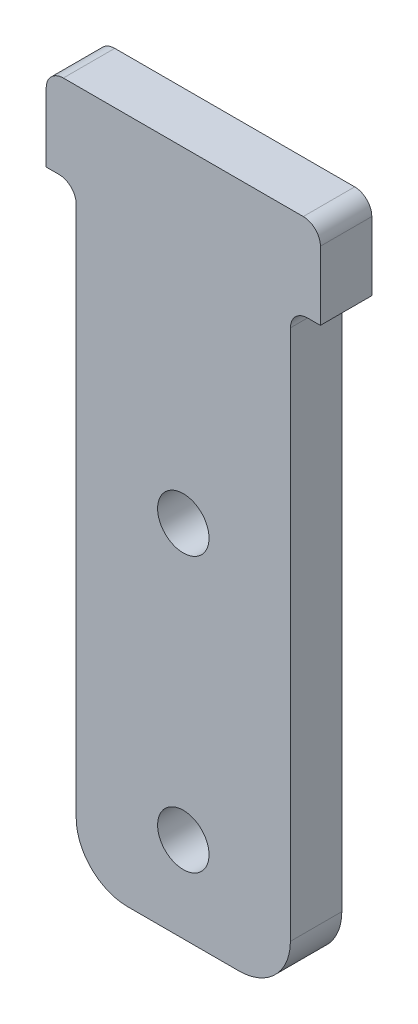
ISO-10303-21;
HEADER;
FILE_DESCRIPTION(('STEP AP214'),'2;1');
FILE_NAME('part.step','',(''),(''),'','','');
FILE_SCHEMA(('AUTOMOTIVE_DESIGN { 1 0 10303 214 1 1 1 1 }'));
ENDSEC;
DATA;
#1=APPLICATION_CONTEXT('core data for automotive mechanical design processes');
#2=APPLICATION_PROTOCOL_DEFINITION('international standard','automotive_design',2000,#1);
#3=PRODUCT_CONTEXT('',#1,'mechanical');
#4=PRODUCT('Part','Part','',(#3));
#5=PRODUCT_RELATED_PRODUCT_CATEGORY('part','',(#4));
#6=PRODUCT_DEFINITION_FORMATION('','',#4);
#7=PRODUCT_DEFINITION_CONTEXT('part definition',#1,'design');
#8=PRODUCT_DEFINITION('design','',#6,#7);
#9=PRODUCT_DEFINITION_SHAPE('','',#8);
#10=(LENGTH_UNIT() NAMED_UNIT(*) SI_UNIT(.MILLI.,.METRE.));
#11=(NAMED_UNIT(*) PLANE_ANGLE_UNIT() SI_UNIT($,.RADIAN.));
#12=(NAMED_UNIT(*) SI_UNIT($,.STERADIAN.) SOLID_ANGLE_UNIT());
#13=UNCERTAINTY_MEASURE_WITH_UNIT(LENGTH_MEASURE(1.E-05),#10,'distance_accuracy_value','');
#14=(GEOMETRIC_REPRESENTATION_CONTEXT(3) GLOBAL_UNCERTAINTY_ASSIGNED_CONTEXT((#13)) GLOBAL_UNIT_ASSIGNED_CONTEXT((#10,
#11,#12)) REPRESENTATION_CONTEXT('',''));
#15=CARTESIAN_POINT('',(0.,0.,0.));
#16=DIRECTION('',(0.,0.,1.));
#17=DIRECTION('',(1.,0.,0.));
#18=AXIS2_PLACEMENT_3D('',#15,#16,#17);
#19=CARTESIAN_POINT('',(0.,0.,3.));
#20=DIRECTION('',(0.,0.,1.));
#21=DIRECTION('',(1.,0.,0.));
#22=AXIS2_PLACEMENT_3D('',#19,#20,#21);
#23=PLANE('',#22);
#24=CARTESIAN_POINT('',(0.,3.5,3.));
#25=DIRECTION('',(0.,0.,1.));
#26=DIRECTION('',(1.,0.,0.));
#27=AXIS2_PLACEMENT_3D('',#24,#25,#26);
#28=CIRCLE('',#27,1.5);
#29=CARTESIAN_POINT('',(1.50000000000001,3.5,3.));
#30=VERTEX_POINT('',#29);
#31=EDGE_CURVE('E179',#30,#30,#28,.T.);
#32=ORIENTED_EDGE('',*,*,#31,.F.);
#33=EDGE_LOOP('',(#32));
#34=FACE_BOUND('',#33,.T.);
#35=DIRECTION('',(1.,0.,0.));
#36=VECTOR('',#35,1.);
#37=CARTESIAN_POINT('',(-6.25,-17.5,3.));
#38=LINE('',#37,#36);
#39=CARTESIAN_POINT('',(-3.24999999999999,-17.5,3.));
#40=VERTEX_POINT('',#39);
#41=CARTESIAN_POINT('',(3.25000000000001,-17.5,3.));
#42=VERTEX_POINT('',#41);
#43=EDGE_CURVE('E166',#40,#42,#38,.T.);
#44=ORIENTED_EDGE('',*,*,#43,.T.);
#45=CARTESIAN_POINT('',(3.25000000000001,-14.5,3.));
#46=DIRECTION('',(0.,0.,1.));
#47=DIRECTION('',(1.,0.,0.));
#48=AXIS2_PLACEMENT_3D('',#45,#46,#47);
#49=CIRCLE('',#48,3.);
#50=CARTESIAN_POINT('',(6.25000000000001,-14.5,3.));
#51=VERTEX_POINT('',#50);
#52=EDGE_CURVE('E41',#42,#51,#49,.T.);
#53=ORIENTED_EDGE('',*,*,#52,.T.);
#54=DIRECTION('',(0.,1.,0.));
#55=VECTOR('',#54,1.);
#56=CARTESIAN_POINT('',(6.25000000000001,17.5,3.));
#57=LINE('',#56,#55);
#58=CARTESIAN_POINT('',(6.25000000000001,16.5,3.));
#59=VERTEX_POINT('',#58);
#60=EDGE_CURVE('E171',#51,#59,#57,.T.);
#61=ORIENTED_EDGE('',*,*,#60,.T.);
#62=CARTESIAN_POINT('',(7.25000000000001,16.5,3.));
#63=DIRECTION('',(0.,0.,1.));
#64=DIRECTION('',(1.,0.,0.));
#65=AXIS2_PLACEMENT_3D('',#62,#63,#64);
#66=CIRCLE('',#65,1.);
#67=CARTESIAN_POINT('',(7.25,17.5,3.));
#68=VERTEX_POINT('',#67);
#69=EDGE_CURVE('E224',#59,#68,#66,.F.);
#70=ORIENTED_EDGE('',*,*,#69,.T.);
#71=DIRECTION('',(1.,0.,0.));
#72=VECTOR('',#71,1.);
#73=CARTESIAN_POINT('',(6.25000000000001,17.5,3.));
#74=LINE('',#73,#72);
#75=CARTESIAN_POINT('',(8.,17.5,3.));
#76=VERTEX_POINT('',#75);
#77=EDGE_CURVE('E173',#68,#76,#74,.T.);
#78=ORIENTED_EDGE('',*,*,#77,.T.);
#79=DIRECTION('',(0.,1.,0.));
#80=VECTOR('',#79,1.);
#81=CARTESIAN_POINT('',(8.,22.5,3.));
#82=LINE('',#81,#80);
#83=CARTESIAN_POINT('',(8.,21.5,3.));
#84=VERTEX_POINT('',#83);
#85=EDGE_CURVE('E193',#76,#84,#82,.T.);
#86=ORIENTED_EDGE('',*,*,#85,.T.);
#87=CARTESIAN_POINT('',(7.,21.5,3.));
#88=DIRECTION('',(0.,0.,1.));
#89=DIRECTION('',(1.,0.,0.));
#90=AXIS2_PLACEMENT_3D('',#87,#88,#89);
#91=CIRCLE('',#90,1.);
#92=CARTESIAN_POINT('',(7.,22.5,3.));
#93=VERTEX_POINT('',#92);
#94=EDGE_CURVE('E206',#84,#93,#91,.T.);
#95=ORIENTED_EDGE('',*,*,#94,.T.);
#96=DIRECTION('',(-1.,0.,0.));
#97=VECTOR('',#96,1.);
#98=CARTESIAN_POINT('',(-8.,22.5,3.));
#99=LINE('',#98,#97);
#100=CARTESIAN_POINT('',(-7.,22.5,3.));
#101=VERTEX_POINT('',#100);
#102=EDGE_CURVE('E148',#93,#101,#99,.T.);
#103=ORIENTED_EDGE('',*,*,#102,.T.);
#104=CARTESIAN_POINT('',(-7.,21.5,3.));
#105=DIRECTION('',(0.,0.,1.));
#106=DIRECTION('',(1.,0.,0.));
#107=AXIS2_PLACEMENT_3D('',#104,#105,#106);
#108=CIRCLE('',#107,1.);
#109=CARTESIAN_POINT('',(-8.,21.5,3.));
#110=VERTEX_POINT('',#109);
#111=EDGE_CURVE('E144',#101,#110,#108,.T.);
#112=ORIENTED_EDGE('',*,*,#111,.T.);
#113=DIRECTION('',(0.,-1.,0.));
#114=VECTOR('',#113,1.);
#115=CARTESIAN_POINT('',(-8.,22.5,3.));
#116=LINE('',#115,#114);
#117=CARTESIAN_POINT('',(-8.,17.5,3.));
#118=VERTEX_POINT('',#117);
#119=EDGE_CURVE('E136',#110,#118,#116,.T.);
#120=ORIENTED_EDGE('',*,*,#119,.T.);
#121=DIRECTION('',(1.,0.,0.));
#122=VECTOR('',#121,1.);
#123=CARTESIAN_POINT('',(-8.,17.5,3.));
#124=LINE('',#123,#122);
#125=CARTESIAN_POINT('',(-7.25,17.5,3.));
#126=VERTEX_POINT('',#125);
#127=EDGE_CURVE('E140',#118,#126,#124,.T.);
#128=ORIENTED_EDGE('',*,*,#127,.T.);
#129=CARTESIAN_POINT('',(-7.25,16.5,3.));
#130=DIRECTION('',(0.,0.,1.));
#131=DIRECTION('',(1.,0.,0.));
#132=AXIS2_PLACEMENT_3D('',#129,#130,#131);
#133=CIRCLE('',#132,1.);
#134=CARTESIAN_POINT('',(-6.25,16.5,3.));
#135=VERTEX_POINT('',#134);
#136=EDGE_CURVE('E228',#126,#135,#133,.F.);
#137=ORIENTED_EDGE('',*,*,#136,.T.);
#138=DIRECTION('',(0.,-1.,0.));
#139=VECTOR('',#138,1.);
#140=CARTESIAN_POINT('',(-6.25,17.5,3.));
#141=LINE('',#140,#139);
#142=CARTESIAN_POINT('',(-6.25,-14.5,3.));
#143=VERTEX_POINT('',#142);
#144=EDGE_CURVE('E164',#135,#143,#141,.T.);
#145=ORIENTED_EDGE('',*,*,#144,.T.);
#146=CARTESIAN_POINT('',(-3.25,-14.5,3.));
#147=DIRECTION('',(0.,0.,1.));
#148=DIRECTION('',(1.,0.,0.));
#149=AXIS2_PLACEMENT_3D('',#146,#147,#148);
#150=CIRCLE('',#149,3.);
#151=EDGE_CURVE('E241',#143,#40,#150,.T.);
#152=ORIENTED_EDGE('',*,*,#151,.T.);
#153=EDGE_LOOP('',(#44,#53,#61,#70,#78,#86,#95,#103,#112,#120,#128,#137,#145,#152));
#154=FACE_BOUND('',#153,.T.);
#155=CARTESIAN_POINT('',(0.,-12.5,3.));
#156=DIRECTION('',(0.,0.,1.));
#157=DIRECTION('',(1.,0.,0.));
#158=AXIS2_PLACEMENT_3D('',#155,#156,#157);
#159=CIRCLE('',#158,1.5);
#160=CARTESIAN_POINT('',(1.50000000000001,-12.5,3.));
#161=VERTEX_POINT('',#160);
#162=EDGE_CURVE('E330',#161,#161,#159,.T.);
#163=ORIENTED_EDGE('',*,*,#162,.F.);
#164=EDGE_LOOP('',(#163));
#165=FACE_BOUND('',#164,.T.);
#166=ADVANCED_FACE('F33',(#34,#154,#165),#23,.T.);
#167=CARTESIAN_POINT('',(0.,0.,0.));
#168=DIRECTION('',(0.,0.,1.));
#169=DIRECTION('',(1.,0.,0.));
#170=AXIS2_PLACEMENT_3D('',#167,#168,#169);
#171=PLANE('',#170);
#172=DIRECTION('',(0.,1.,0.));
#173=VECTOR('',#172,1.);
#174=CARTESIAN_POINT('',(6.25000000000001,17.5,0.));
#175=LINE('',#174,#173);
#176=CARTESIAN_POINT('',(6.25000000000001,-14.5,0.));
#177=VERTEX_POINT('',#176);
#178=CARTESIAN_POINT('',(6.25000000000001,16.5,0.));
#179=VERTEX_POINT('',#178);
#180=EDGE_CURVE('E189',#177,#179,#175,.T.);
#181=ORIENTED_EDGE('',*,*,#180,.F.);
#182=CARTESIAN_POINT('',(3.25000000000001,-14.5,0.));
#183=DIRECTION('',(0.,0.,1.));
#184=DIRECTION('',(1.,0.,0.));
#185=AXIS2_PLACEMENT_3D('',#182,#183,#184);
#186=CIRCLE('',#185,3.);
#187=CARTESIAN_POINT('',(3.25000000000001,-17.5,0.));
#188=VERTEX_POINT('',#187);
#189=EDGE_CURVE('E235',#177,#188,#186,.F.);
#190=ORIENTED_EDGE('',*,*,#189,.T.);
#191=DIRECTION('',(1.,0.,0.));
#192=VECTOR('',#191,1.);
#193=CARTESIAN_POINT('',(-6.25,-17.5,0.));
#194=LINE('',#193,#192);
#195=CARTESIAN_POINT('',(-3.24999999999999,-17.5,0.));
#196=VERTEX_POINT('',#195);
#197=EDGE_CURVE('E187',#196,#188,#194,.T.);
#198=ORIENTED_EDGE('',*,*,#197,.F.);
#199=CARTESIAN_POINT('',(-3.25,-14.5,0.));
#200=DIRECTION('',(0.,0.,1.));
#201=DIRECTION('',(1.,0.,0.));
#202=AXIS2_PLACEMENT_3D('',#199,#200,#201);
#203=CIRCLE('',#202,3.);
#204=CARTESIAN_POINT('',(-6.25,-14.5,0.));
#205=VERTEX_POINT('',#204);
#206=EDGE_CURVE('E233',#196,#205,#203,.F.);
#207=ORIENTED_EDGE('',*,*,#206,.T.);
#208=DIRECTION('',(0.,-1.,0.));
#209=VECTOR('',#208,1.);
#210=CARTESIAN_POINT('',(-6.25,17.5,0.));
#211=LINE('',#210,#209);
#212=CARTESIAN_POINT('',(-6.25,16.5,0.));
#213=VERTEX_POINT('',#212);
#214=EDGE_CURVE('E185',#213,#205,#211,.T.);
#215=ORIENTED_EDGE('',*,*,#214,.F.);
#216=CARTESIAN_POINT('',(-7.25,16.5,0.));
#217=DIRECTION('',(0.,0.,1.));
#218=DIRECTION('',(1.,0.,0.));
#219=AXIS2_PLACEMENT_3D('',#216,#217,#218);
#220=CIRCLE('',#219,1.);
#221=CARTESIAN_POINT('',(-7.25,17.5,0.));
#222=VERTEX_POINT('',#221);
#223=EDGE_CURVE('E226',#213,#222,#220,.T.);
#224=ORIENTED_EDGE('',*,*,#223,.T.);
#225=DIRECTION('',(1.,0.,0.));
#226=VECTOR('',#225,1.);
#227=CARTESIAN_POINT('',(-8.,17.5,0.));
#228=LINE('',#227,#226);
#229=CARTESIAN_POINT('',(-8.,17.5,0.));
#230=VERTEX_POINT('',#229);
#231=EDGE_CURVE('E183',#230,#222,#228,.T.);
#232=ORIENTED_EDGE('',*,*,#231,.F.);
#233=DIRECTION('',(0.,-1.,0.));
#234=VECTOR('',#233,1.);
#235=CARTESIAN_POINT('',(-8.,22.5,0.));
#236=LINE('',#235,#234);
#237=CARTESIAN_POINT('',(-8.,21.5,0.));
#238=VERTEX_POINT('',#237);
#239=EDGE_CURVE('E154',#238,#230,#236,.T.);
#240=ORIENTED_EDGE('',*,*,#239,.F.);
#241=CARTESIAN_POINT('',(-7.,21.5,0.));
#242=DIRECTION('',(0.,0.,1.));
#243=DIRECTION('',(1.,0.,0.));
#244=AXIS2_PLACEMENT_3D('',#241,#242,#243);
#245=CIRCLE('',#244,1.);
#246=CARTESIAN_POINT('',(-7.,22.5,0.));
#247=VERTEX_POINT('',#246);
#248=EDGE_CURVE('E199',#238,#247,#245,.F.);
#249=ORIENTED_EDGE('',*,*,#248,.T.);
#250=DIRECTION('',(-1.,0.,0.));
#251=VECTOR('',#250,1.);
#252=CARTESIAN_POINT('',(-8.,22.5,0.));
#253=LINE('',#252,#251);
#254=CARTESIAN_POINT('',(7.,22.5,0.));
#255=VERTEX_POINT('',#254);
#256=EDGE_CURVE('E178',#255,#247,#253,.T.);
#257=ORIENTED_EDGE('',*,*,#256,.F.);
#258=CARTESIAN_POINT('',(7.,21.5,0.));
#259=DIRECTION('',(0.,0.,1.));
#260=DIRECTION('',(1.,0.,0.));
#261=AXIS2_PLACEMENT_3D('',#258,#259,#260);
#262=CIRCLE('',#261,1.);
#263=CARTESIAN_POINT('',(8.,21.5,0.));
#264=VERTEX_POINT('',#263);
#265=EDGE_CURVE('E197',#255,#264,#262,.F.);
#266=ORIENTED_EDGE('',*,*,#265,.T.);
#267=DIRECTION('',(0.,1.,0.));
#268=VECTOR('',#267,1.);
#269=CARTESIAN_POINT('',(8.,22.5,0.));
#270=LINE('',#269,#268);
#271=CARTESIAN_POINT('',(8.,17.5,0.));
#272=VERTEX_POINT('',#271);
#273=EDGE_CURVE('E175',#272,#264,#270,.T.);
#274=ORIENTED_EDGE('',*,*,#273,.F.);
#275=DIRECTION('',(1.,0.,0.));
#276=VECTOR('',#275,1.);
#277=CARTESIAN_POINT('',(6.25000000000001,17.5,0.));
#278=LINE('',#277,#276);
#279=CARTESIAN_POINT('',(7.25,17.5,0.));
#280=VERTEX_POINT('',#279);
#281=EDGE_CURVE('E191',#280,#272,#278,.T.);
#282=ORIENTED_EDGE('',*,*,#281,.F.);
#283=CARTESIAN_POINT('',(7.25000000000001,16.5,0.));
#284=DIRECTION('',(0.,0.,1.));
#285=DIRECTION('',(1.,0.,0.));
#286=AXIS2_PLACEMENT_3D('',#283,#284,#285);
#287=CIRCLE('',#286,1.);
#288=EDGE_CURVE('E221',#280,#179,#287,.T.);
#289=ORIENTED_EDGE('',*,*,#288,.T.);
#290=EDGE_LOOP('',(#181,#190,#198,#207,#215,#224,#232,#240,#249,#257,#266,#274,#282,#289));
#291=FACE_BOUND('',#290,.T.);
#292=CARTESIAN_POINT('',(0.,3.5,0.));
#293=DIRECTION('',(0.,0.,1.));
#294=DIRECTION('',(1.,0.,0.));
#295=AXIS2_PLACEMENT_3D('',#292,#293,#294);
#296=CIRCLE('',#295,1.5);
#297=CARTESIAN_POINT('',(1.50000000000001,3.5,0.));
#298=VERTEX_POINT('',#297);
#299=EDGE_CURVE('E327',#298,#298,#296,.T.);
#300=ORIENTED_EDGE('',*,*,#299,.T.);
#301=EDGE_LOOP('',(#300));
#302=FACE_BOUND('',#301,.T.);
#303=CARTESIAN_POINT('',(0.,-12.5,0.));
#304=DIRECTION('',(0.,0.,1.));
#305=DIRECTION('',(1.,0.,0.));
#306=AXIS2_PLACEMENT_3D('',#303,#304,#305);
#307=CIRCLE('',#306,1.5);
#308=CARTESIAN_POINT('',(1.50000000000001,-12.5,0.));
#309=VERTEX_POINT('',#308);
#310=EDGE_CURVE('E333',#309,#309,#307,.T.);
#311=ORIENTED_EDGE('',*,*,#310,.T.);
#312=EDGE_LOOP('',(#311));
#313=FACE_BOUND('',#312,.T.);
#314=ADVANCED_FACE('F254',(#291,#302,#313),#171,.F.);
#315=CARTESIAN_POINT('',(8.,22.5,3.));
#316=DIRECTION('',(-1.,0.,0.));
#317=DIRECTION('',(0.,0.,1.));
#318=AXIS2_PLACEMENT_3D('',#315,#316,#317);
#319=PLANE('',#318);
#320=ORIENTED_EDGE('',*,*,#273,.T.);
#321=DIRECTION('',(0.,0.,-1.));
#322=VECTOR('',#321,1.);
#323=CARTESIAN_POINT('',(8.,21.5,3.));
#324=LINE('',#323,#322);
#325=EDGE_CURVE('E209',#264,#84,#324,.F.);
#326=ORIENTED_EDGE('',*,*,#325,.T.);
#327=ORIENTED_EDGE('',*,*,#85,.F.);
#328=DIRECTION('',(0.,0.,-1.));
#329=VECTOR('',#328,1.);
#330=CARTESIAN_POINT('',(8.,17.5,3.));
#331=LINE('',#330,#329);
#332=EDGE_CURVE('E159',#76,#272,#331,.T.);
#333=ORIENTED_EDGE('',*,*,#332,.T.);
#334=EDGE_LOOP('',(#320,#326,#327,#333));
#335=FACE_BOUND('',#334,.T.);
#336=ADVANCED_FACE('F294',(#335),#319,.F.);
#337=CARTESIAN_POINT('',(-8.,22.5,3.));
#338=DIRECTION('',(0.,-1.,0.));
#339=DIRECTION('',(0.,0.,-1.));
#340=AXIS2_PLACEMENT_3D('',#337,#338,#339);
#341=PLANE('',#340);
#342=ORIENTED_EDGE('',*,*,#256,.T.);
#343=DIRECTION('',(0.,0.,-1.));
#344=VECTOR('',#343,1.);
#345=CARTESIAN_POINT('',(-7.,22.5,3.));
#346=LINE('',#345,#344);
#347=EDGE_CURVE('E204',#247,#101,#346,.F.);
#348=ORIENTED_EDGE('',*,*,#347,.T.);
#349=ORIENTED_EDGE('',*,*,#102,.F.);
#350=DIRECTION('',(0.,0.,-1.));
#351=VECTOR('',#350,1.);
#352=CARTESIAN_POINT('',(7.,22.5,3.));
#353=LINE('',#352,#351);
#354=EDGE_CURVE('E201',#93,#255,#353,.T.);
#355=ORIENTED_EDGE('',*,*,#354,.T.);
#356=EDGE_LOOP('',(#342,#348,#349,#355));
#357=FACE_BOUND('',#356,.T.);
#358=ADVANCED_FACE('F269',(#357),#341,.F.);
#359=CARTESIAN_POINT('',(-8.,22.5,3.));
#360=DIRECTION('',(1.,0.,0.));
#361=DIRECTION('',(0.,1.,0.));
#362=AXIS2_PLACEMENT_3D('',#359,#360,#361);
#363=PLANE('',#362);
#364=ORIENTED_EDGE('',*,*,#119,.F.);
#365=DIRECTION('',(0.,0.,-1.));
#366=VECTOR('',#365,1.);
#367=CARTESIAN_POINT('',(-8.,21.5,3.));
#368=LINE('',#367,#366);
#369=EDGE_CURVE('E158',#110,#238,#368,.T.);
#370=ORIENTED_EDGE('',*,*,#369,.T.);
#371=ORIENTED_EDGE('',*,*,#239,.T.);
#372=DIRECTION('',(0.,0.,-1.));
#373=VECTOR('',#372,1.);
#374=CARTESIAN_POINT('',(-8.,17.5,3.));
#375=LINE('',#374,#373);
#376=EDGE_CURVE('E151',#118,#230,#375,.T.);
#377=ORIENTED_EDGE('',*,*,#376,.F.);
#378=EDGE_LOOP('',(#364,#370,#371,#377));
#379=FACE_BOUND('',#378,.T.);
#380=ADVANCED_FACE('F152',(#379),#363,.F.);
#381=CARTESIAN_POINT('',(-8.,17.5,3.));
#382=DIRECTION('',(0.,1.,0.));
#383=DIRECTION('',(0.,0.,1.));
#384=AXIS2_PLACEMENT_3D('',#381,#382,#383);
#385=PLANE('',#384);
#386=ORIENTED_EDGE('',*,*,#231,.T.);
#387=DIRECTION('',(0.,0.,-1.));
#388=VECTOR('',#387,1.);
#389=CARTESIAN_POINT('',(-7.25,17.5,3.));
#390=LINE('',#389,#388);
#391=EDGE_CURVE('E163',#222,#126,#390,.F.);
#392=ORIENTED_EDGE('',*,*,#391,.T.);
#393=ORIENTED_EDGE('',*,*,#127,.F.);
#394=ORIENTED_EDGE('',*,*,#376,.T.);
#395=EDGE_LOOP('',(#386,#392,#393,#394));
#396=FACE_BOUND('',#395,.T.);
#397=ADVANCED_FACE('F161',(#396),#385,.F.);
#398=CARTESIAN_POINT('',(-6.25,17.5,3.));
#399=DIRECTION('',(1.,0.,0.));
#400=DIRECTION('',(0.,1.,0.));
#401=AXIS2_PLACEMENT_3D('',#398,#399,#400);
#402=PLANE('',#401);
#403=ORIENTED_EDGE('',*,*,#214,.T.);
#404=DIRECTION('',(0.,0.,-1.));
#405=VECTOR('',#404,1.);
#406=CARTESIAN_POINT('',(-6.25,-14.5,3.));
#407=LINE('',#406,#405);
#408=EDGE_CURVE('E11',#205,#143,#407,.F.);
#409=ORIENTED_EDGE('',*,*,#408,.T.);
#410=ORIENTED_EDGE('',*,*,#144,.F.);
#411=DIRECTION('',(0.,0.,-1.));
#412=VECTOR('',#411,1.);
#413=CARTESIAN_POINT('',(-6.25,16.5,0.));
#414=LINE('',#413,#412);
#415=EDGE_CURVE('E217',#135,#213,#414,.T.);
#416=ORIENTED_EDGE('',*,*,#415,.T.);
#417=EDGE_LOOP('',(#403,#409,#410,#416));
#418=FACE_BOUND('',#417,.T.);
#419=ADVANCED_FACE('F261',(#418),#402,.F.);
#420=CARTESIAN_POINT('',(-6.25,-17.5,3.));
#421=DIRECTION('',(0.,1.,0.));
#422=DIRECTION('',(-1.,0.,0.));
#423=AXIS2_PLACEMENT_3D('',#420,#421,#422);
#424=PLANE('',#423);
#425=ORIENTED_EDGE('',*,*,#197,.T.);
#426=DIRECTION('',(0.,0.,-1.));
#427=VECTOR('',#426,1.);
#428=CARTESIAN_POINT('',(3.25000000000001,-17.5,3.));
#429=LINE('',#428,#427);
#430=EDGE_CURVE('E54',#188,#42,#429,.F.);
#431=ORIENTED_EDGE('',*,*,#430,.T.);
#432=ORIENTED_EDGE('',*,*,#43,.F.);
#433=DIRECTION('',(0.,0.,-1.));
#434=VECTOR('',#433,1.);
#435=CARTESIAN_POINT('',(-3.24999999999999,-17.5,3.));
#436=LINE('',#435,#434);
#437=EDGE_CURVE('E237',#40,#196,#436,.T.);
#438=ORIENTED_EDGE('',*,*,#437,.T.);
#439=EDGE_LOOP('',(#425,#431,#432,#438));
#440=FACE_BOUND('',#439,.T.);
#441=ADVANCED_FACE('F256',(#440),#424,.F.);
#442=CARTESIAN_POINT('',(6.25000000000001,17.5,3.));
#443=DIRECTION('',(-1.,0.,0.));
#444=DIRECTION('',(0.,0.,1.));
#445=AXIS2_PLACEMENT_3D('',#442,#443,#444);
#446=PLANE('',#445);
#447=ORIENTED_EDGE('',*,*,#60,.F.);
#448=DIRECTION('',(0.,0.,-1.));
#449=VECTOR('',#448,1.);
#450=CARTESIAN_POINT('',(6.25000000000001,-14.5,3.));
#451=LINE('',#450,#449);
#452=EDGE_CURVE('E230',#51,#177,#451,.T.);
#453=ORIENTED_EDGE('',*,*,#452,.T.);
#454=ORIENTED_EDGE('',*,*,#180,.T.);
#455=DIRECTION('',(0.,0.,-1.));
#456=VECTOR('',#455,1.);
#457=CARTESIAN_POINT('',(6.25000000000001,16.5,3.));
#458=LINE('',#457,#456);
#459=EDGE_CURVE('E214',#179,#59,#458,.F.);
#460=ORIENTED_EDGE('',*,*,#459,.T.);
#461=EDGE_LOOP('',(#447,#453,#454,#460));
#462=FACE_BOUND('',#461,.T.);
#463=ADVANCED_FACE('F247',(#462),#446,.F.);
#464=CARTESIAN_POINT('',(6.25000000000001,17.5,3.));
#465=DIRECTION('',(0.,1.,0.));
#466=DIRECTION('',(0.,0.,1.));
#467=AXIS2_PLACEMENT_3D('',#464,#465,#466);
#468=PLANE('',#467);
#469=ORIENTED_EDGE('',*,*,#77,.F.);
#470=DIRECTION('',(0.,0.,-1.));
#471=VECTOR('',#470,1.);
#472=CARTESIAN_POINT('',(7.25000000000001,17.5,0.));
#473=LINE('',#472,#471);
#474=EDGE_CURVE('E211',#68,#280,#473,.T.);
#475=ORIENTED_EDGE('',*,*,#474,.T.);
#476=ORIENTED_EDGE('',*,*,#281,.T.);
#477=ORIENTED_EDGE('',*,*,#332,.F.);
#478=EDGE_LOOP('',(#469,#475,#476,#477));
#479=FACE_BOUND('',#478,.T.);
#480=ADVANCED_FACE('F299',(#479),#468,.F.);
#481=CARTESIAN_POINT('',(0.,3.5,3.));
#482=DIRECTION('',(0.,0.,-1.));
#483=DIRECTION('',(-1.,0.,0.));
#484=AXIS2_PLACEMENT_3D('',#481,#482,#483);
#485=CYLINDRICAL_SURFACE('',#484,1.5);
#486=ORIENTED_EDGE('',*,*,#31,.T.);
#487=EDGE_LOOP('',(#486));
#488=FACE_BOUND('',#487,.T.);
#489=ORIENTED_EDGE('',*,*,#299,.F.);
#490=EDGE_LOOP('',(#489));
#491=FACE_BOUND('',#490,.T.);
#492=ADVANCED_FACE('F284',(#488,#491),#485,.F.);
#493=CARTESIAN_POINT('',(0.,-12.5,3.));
#494=DIRECTION('',(0.,0.,-1.));
#495=DIRECTION('',(-1.,0.,0.));
#496=AXIS2_PLACEMENT_3D('',#493,#494,#495);
#497=CYLINDRICAL_SURFACE('',#496,1.5);
#498=ORIENTED_EDGE('',*,*,#162,.T.);
#499=EDGE_LOOP('',(#498));
#500=FACE_BOUND('',#499,.T.);
#501=ORIENTED_EDGE('',*,*,#310,.F.);
#502=EDGE_LOOP('',(#501));
#503=FACE_BOUND('',#502,.T.);
#504=ADVANCED_FACE('F275',(#500,#503),#497,.F.);
#505=CARTESIAN_POINT('',(-7.,21.5,3.));
#506=DIRECTION('',(0.,0.,-1.));
#507=DIRECTION('',(-1.,0.,0.));
#508=AXIS2_PLACEMENT_3D('',#505,#506,#507);
#509=CYLINDRICAL_SURFACE('',#508,1.);
#510=ORIENTED_EDGE('',*,*,#111,.F.);
#511=ORIENTED_EDGE('',*,*,#347,.F.);
#512=ORIENTED_EDGE('',*,*,#248,.F.);
#513=ORIENTED_EDGE('',*,*,#369,.F.);
#514=EDGE_LOOP('',(#510,#511,#512,#513));
#515=FACE_BOUND('',#514,.T.);
#516=ADVANCED_FACE('F272',(#515),#509,.T.);
#517=CARTESIAN_POINT('',(7.,21.5,3.));
#518=DIRECTION('',(0.,0.,-1.));
#519=DIRECTION('',(-1.,0.,0.));
#520=AXIS2_PLACEMENT_3D('',#517,#518,#519);
#521=CYLINDRICAL_SURFACE('',#520,1.);
#522=ORIENTED_EDGE('',*,*,#94,.F.);
#523=ORIENTED_EDGE('',*,*,#325,.F.);
#524=ORIENTED_EDGE('',*,*,#265,.F.);
#525=ORIENTED_EDGE('',*,*,#354,.F.);
#526=EDGE_LOOP('',(#522,#523,#524,#525));
#527=FACE_BOUND('',#526,.T.);
#528=ADVANCED_FACE('F274',(#527),#521,.T.);
#529=CARTESIAN_POINT('',(7.25000000000001,16.5,3.));
#530=DIRECTION('',(0.,0.,1.));
#531=DIRECTION('',(1.,0.,0.));
#532=AXIS2_PLACEMENT_3D('',#529,#530,#531);
#533=CYLINDRICAL_SURFACE('',#532,1.);
#534=ORIENTED_EDGE('',*,*,#69,.F.);
#535=ORIENTED_EDGE('',*,*,#459,.F.);
#536=ORIENTED_EDGE('',*,*,#288,.F.);
#537=ORIENTED_EDGE('',*,*,#474,.F.);
#538=EDGE_LOOP('',(#534,#535,#536,#537));
#539=FACE_BOUND('',#538,.T.);
#540=ADVANCED_FACE('F281',(#539),#533,.F.);
#541=CARTESIAN_POINT('',(-7.25,16.5,3.));
#542=DIRECTION('',(0.,0.,1.));
#543=DIRECTION('',(1.,0.,0.));
#544=AXIS2_PLACEMENT_3D('',#541,#542,#543);
#545=CYLINDRICAL_SURFACE('',#544,1.);
#546=ORIENTED_EDGE('',*,*,#136,.F.);
#547=ORIENTED_EDGE('',*,*,#391,.F.);
#548=ORIENTED_EDGE('',*,*,#223,.F.);
#549=ORIENTED_EDGE('',*,*,#415,.F.);
#550=EDGE_LOOP('',(#546,#547,#548,#549));
#551=FACE_BOUND('',#550,.T.);
#552=ADVANCED_FACE('F264',(#551),#545,.F.);
#553=CARTESIAN_POINT('',(3.25000000000001,-14.5,3.));
#554=DIRECTION('',(0.,0.,-1.));
#555=DIRECTION('',(-1.,0.,0.));
#556=AXIS2_PLACEMENT_3D('',#553,#554,#555);
#557=CYLINDRICAL_SURFACE('',#556,3.);
#558=ORIENTED_EDGE('',*,*,#52,.F.);
#559=ORIENTED_EDGE('',*,*,#430,.F.);
#560=ORIENTED_EDGE('',*,*,#189,.F.);
#561=ORIENTED_EDGE('',*,*,#452,.F.);
#562=EDGE_LOOP('',(#558,#559,#560,#561));
#563=FACE_BOUND('',#562,.T.);
#564=ADVANCED_FACE('F251',(#563),#557,.T.);
#565=CARTESIAN_POINT('',(-3.25,-14.5,3.));
#566=DIRECTION('',(0.,0.,-1.));
#567=DIRECTION('',(-1.,0.,0.));
#568=AXIS2_PLACEMENT_3D('',#565,#566,#567);
#569=CYLINDRICAL_SURFACE('',#568,3.);
#570=ORIENTED_EDGE('',*,*,#151,.F.);
#571=ORIENTED_EDGE('',*,*,#408,.F.);
#572=ORIENTED_EDGE('',*,*,#206,.F.);
#573=ORIENTED_EDGE('',*,*,#437,.F.);
#574=EDGE_LOOP('',(#570,#571,#572,#573));
#575=FACE_BOUND('',#574,.T.);
#576=ADVANCED_FACE('F35',(#575),#569,.T.);
#577=CLOSED_SHELL('',(#166,#314,#336,#358,#380,#397,#419,#441,#463,#480,#492,#504,#516,#528,
#540,#552,#564,#576));
#578=MANIFOLD_SOLID_BREP('B2',#577);
#579=ADVANCED_BREP_SHAPE_REPRESENTATION('',(#18,#578),#14);
#580=SHAPE_DEFINITION_REPRESENTATION(#9,#579);
ENDSEC;
END-ISO-10303-21;
